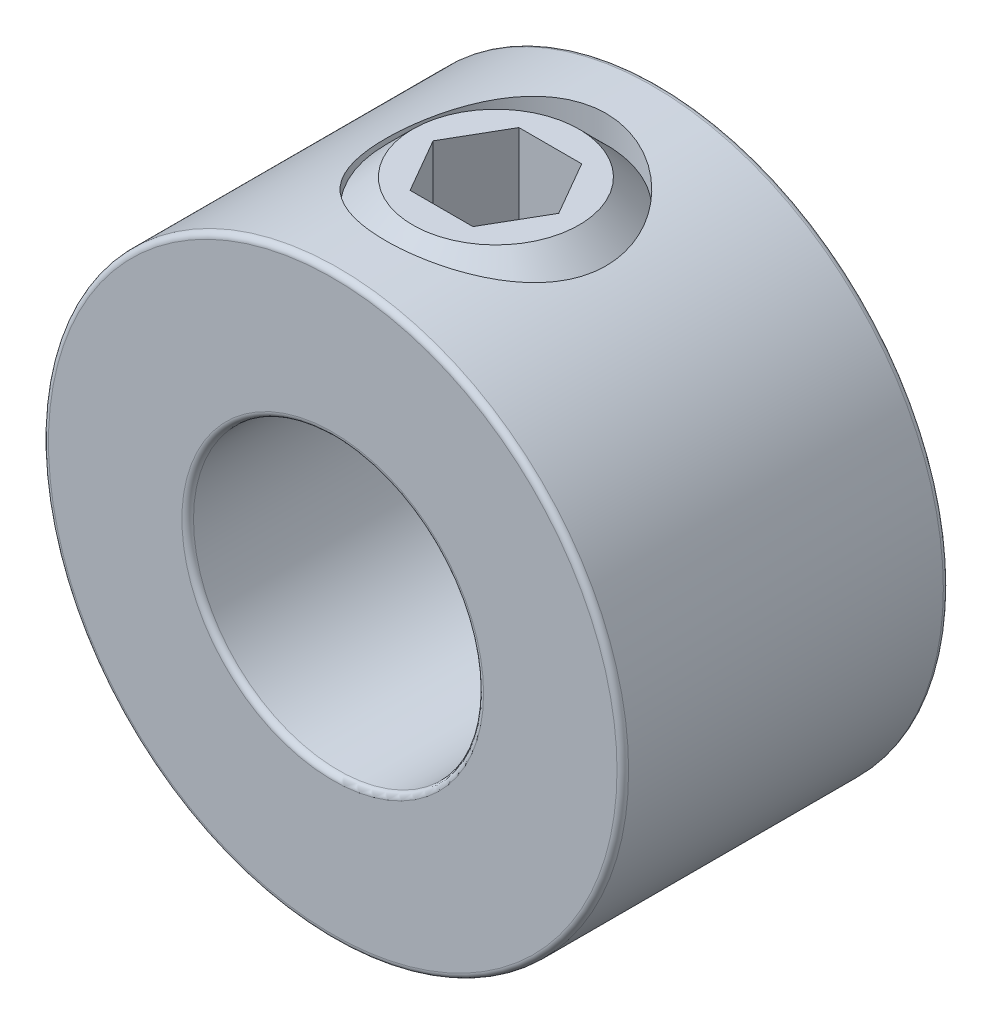
ISO-10303-21;
HEADER;
FILE_DESCRIPTION(('STEP AP214'),'2;1');
FILE_NAME('part.step','',(''),(''),'','','');
FILE_SCHEMA(('AUTOMOTIVE_DESIGN { 1 0 10303 214 1 1 1 1 }'));
ENDSEC;
DATA;
#1=APPLICATION_CONTEXT('core data for automotive mechanical design processes');
#2=APPLICATION_PROTOCOL_DEFINITION('international standard','automotive_design',2000,#1);
#3=PRODUCT_CONTEXT('',#1,'mechanical');
#4=PRODUCT('Part','Part','',(#3));
#5=PRODUCT_RELATED_PRODUCT_CATEGORY('part','',(#4));
#6=PRODUCT_DEFINITION_FORMATION('','',#4);
#7=PRODUCT_DEFINITION_CONTEXT('part definition',#1,'design');
#8=PRODUCT_DEFINITION('design','',#6,#7);
#9=PRODUCT_DEFINITION_SHAPE('','',#8);
#10=(LENGTH_UNIT() NAMED_UNIT(*) SI_UNIT(.MILLI.,.METRE.));
#11=(NAMED_UNIT(*) PLANE_ANGLE_UNIT() SI_UNIT($,.RADIAN.));
#12=(NAMED_UNIT(*) SI_UNIT($,.STERADIAN.) SOLID_ANGLE_UNIT());
#13=UNCERTAINTY_MEASURE_WITH_UNIT(LENGTH_MEASURE(1.E-05),#10,'distance_accuracy_value','');
#14=(GEOMETRIC_REPRESENTATION_CONTEXT(3) GLOBAL_UNCERTAINTY_ASSIGNED_CONTEXT((#13)) GLOBAL_UNIT_ASSIGNED_CONTEXT((#10,
#11,#12)) REPRESENTATION_CONTEXT('',''));
#15=CARTESIAN_POINT('',(0.,0.,0.));
#16=DIRECTION('',(0.,0.,1.));
#17=DIRECTION('',(1.,0.,0.));
#18=AXIS2_PLACEMENT_3D('',#15,#16,#17);
#19=CARTESIAN_POINT('',(0.,6.35,0.));
#20=DIRECTION('',(0.,1.,0.));
#21=DIRECTION('',(-1.,0.,0.));
#22=AXIS2_PLACEMENT_3D('',#19,#20,#21);
#23=PLANE('',#22);
#24=CARTESIAN_POINT('',(0.,6.35,0.));
#25=DIRECTION('',(0.,1.,0.));
#26=DIRECTION('',(-1.,0.,0.));
#27=AXIS2_PLACEMENT_3D('',#24,#25,#26);
#28=CIRCLE('',#27,1.81975161629017);
#29=CARTESIAN_POINT('',(-1.81975161629017,6.35,0.));
#30=VERTEX_POINT('',#29);
#31=EDGE_CURVE('E12',#30,#30,#28,.T.);
#32=ORIENTED_EDGE('',*,*,#31,.T.);
#33=EDGE_LOOP('',(#32));
#34=FACE_BOUND('',#33,.T.);
#35=DIRECTION('',(1.,0.,0.));
#36=VECTOR('',#35,1.);
#37=CARTESIAN_POINT('',(-0.687407664253899,6.34999999999999,-1.190625));
#38=LINE('',#37,#36);
#39=CARTESIAN_POINT('',(-0.687407664253899,6.34999999999999,-1.190625));
#40=VERTEX_POINT('',#39);
#41=CARTESIAN_POINT('',(0.687407664253899,6.35,-1.190625));
#42=VERTEX_POINT('',#41);
#43=EDGE_CURVE('E115',#40,#42,#38,.T.);
#44=ORIENTED_EDGE('',*,*,#43,.T.);
#45=DIRECTION('',(0.5,0.,0.866025403784439));
#46=VECTOR('',#45,1.);
#47=CARTESIAN_POINT('',(0.687407664253899,6.34999999999999,-1.190625));
#48=LINE('',#47,#46);
#49=CARTESIAN_POINT('',(1.3748153285078,6.34999999999999,0.));
#50=VERTEX_POINT('',#49);
#51=EDGE_CURVE('E61',#42,#50,#48,.T.);
#52=ORIENTED_EDGE('',*,*,#51,.T.);
#53=DIRECTION('',(-0.5,0.,0.866025403784439));
#54=VECTOR('',#53,1.);
#55=CARTESIAN_POINT('',(1.3748153285078,6.34999999999999,0.));
#56=LINE('',#55,#54);
#57=CARTESIAN_POINT('',(0.687407664253899,6.34999999999999,1.190625));
#58=VERTEX_POINT('',#57);
#59=EDGE_CURVE('E119',#50,#58,#56,.T.);
#60=ORIENTED_EDGE('',*,*,#59,.T.);
#61=DIRECTION('',(-1.,0.,0.));
#62=VECTOR('',#61,1.);
#63=CARTESIAN_POINT('',(0.687407664253899,6.34999999999999,1.190625));
#64=LINE('',#63,#62);
#65=CARTESIAN_POINT('',(-0.687407664253899,6.34999999999999,1.190625));
#66=VERTEX_POINT('',#65);
#67=EDGE_CURVE('E182',#58,#66,#64,.T.);
#68=ORIENTED_EDGE('',*,*,#67,.T.);
#69=DIRECTION('',(-0.5,0.,-0.866025403784439));
#70=VECTOR('',#69,1.);
#71=CARTESIAN_POINT('',(-0.687407664253899,6.34999999999999,1.190625));
#72=LINE('',#71,#70);
#73=CARTESIAN_POINT('',(-1.3748153285078,6.34999999999999,0.));
#74=VERTEX_POINT('',#73);
#75=EDGE_CURVE('E167',#66,#74,#72,.T.);
#76=ORIENTED_EDGE('',*,*,#75,.T.);
#77=DIRECTION('',(0.5,0.,-0.866025403784439));
#78=VECTOR('',#77,1.);
#79=CARTESIAN_POINT('',(-1.3748153285078,6.34999999999999,0.));
#80=LINE('',#79,#78);
#81=EDGE_CURVE('E163',#74,#40,#80,.T.);
#82=ORIENTED_EDGE('',*,*,#81,.T.);
#83=EDGE_LOOP('',(#44,#52,#60,#68,#76,#82));
#84=FACE_BOUND('',#83,.T.);
#85=ADVANCED_FACE('F47',(#34,#84),#23,.T.);
#86=CARTESIAN_POINT('',(0.,6.35,0.));
#87=DIRECTION('',(0.,-1.,0.));
#88=DIRECTION('',(1.,0.,0.));
#89=AXIS2_PLACEMENT_3D('',#86,#87,#88);
#90=CONICAL_SURFACE('',#89,1.81975161629017,0.785398163397449);
#91=CARTESIAN_POINT('',(0.,5.75675161629017,0.));
#92=DIRECTION('',(0.,1.,0.));
#93=DIRECTION('',(-1.,0.,0.));
#94=AXIS2_PLACEMENT_3D('',#91,#92,#93);
#95=CIRCLE('',#94,2.413);
#96=CARTESIAN_POINT('',(-2.413,5.75675161629017,0.));
#97=VERTEX_POINT('',#96);
#98=EDGE_CURVE('E54',#97,#97,#95,.T.);
#99=ORIENTED_EDGE('',*,*,#98,.T.);
#100=EDGE_LOOP('',(#99));
#101=FACE_BOUND('',#100,.T.);
#102=ORIENTED_EDGE('',*,*,#31,.F.);
#103=EDGE_LOOP('',(#102));
#104=FACE_BOUND('',#103,.T.);
#105=ADVANCED_FACE('F137',(#101,#104),#90,.T.);
#106=CARTESIAN_POINT('',(0.,3.175,0.));
#107=DIRECTION('',(0.,1.,0.));
#108=DIRECTION('',(-1.,0.,0.));
#109=AXIS2_PLACEMENT_3D('',#106,#107,#108);
#110=CYLINDRICAL_SURFACE('',#109,2.413);
#111=CARTESIAN_POINT('',(0.,3.76824838370983,0.));
#112=DIRECTION('',(0.,1.,0.));
#113=DIRECTION('',(-1.,0.,0.));
#114=AXIS2_PLACEMENT_3D('',#111,#112,#113);
#115=CIRCLE('',#114,2.413);
#116=CARTESIAN_POINT('',(-2.413,3.76824838370983,0.));
#117=VERTEX_POINT('',#116);
#118=EDGE_CURVE('E132',#117,#117,#115,.T.);
#119=ORIENTED_EDGE('',*,*,#118,.T.);
#120=EDGE_LOOP('',(#119));
#121=FACE_BOUND('',#120,.T.);
#122=ORIENTED_EDGE('',*,*,#98,.F.);
#123=EDGE_LOOP('',(#122));
#124=FACE_BOUND('',#123,.T.);
#125=ADVANCED_FACE('F140',(#121,#124),#110,.T.);
#126=CARTESIAN_POINT('',(0.,3.76824838370983,0.));
#127=DIRECTION('',(0.,1.,0.));
#128=DIRECTION('',(-1.,0.,0.));
#129=AXIS2_PLACEMENT_3D('',#126,#127,#128);
#130=CONICAL_SURFACE('',#129,2.413,0.785398163397448);
#131=CARTESIAN_POINT('',(0.,3.175,0.));
#132=DIRECTION('',(0.,1.,0.));
#133=DIRECTION('',(-1.,0.,0.));
#134=AXIS2_PLACEMENT_3D('',#131,#132,#133);
#135=CIRCLE('',#134,1.81975161629017);
#136=CARTESIAN_POINT('',(-1.81975161629017,3.175,0.));
#137=VERTEX_POINT('',#136);
#138=EDGE_CURVE('E124',#137,#137,#135,.T.);
#139=ORIENTED_EDGE('',*,*,#138,.T.);
#140=EDGE_LOOP('',(#139));
#141=FACE_BOUND('',#140,.T.);
#142=ORIENTED_EDGE('',*,*,#118,.F.);
#143=EDGE_LOOP('',(#142));
#144=FACE_BOUND('',#143,.T.);
#145=ADVANCED_FACE('F142',(#141,#144),#130,.T.);
#146=CARTESIAN_POINT('',(-1.81975161629017,3.175,0.));
#147=DIRECTION('',(0.,-1.,0.));
#148=DIRECTION('',(1.,0.,0.));
#149=AXIS2_PLACEMENT_3D('',#146,#147,#148);
#150=PLANE('',#149);
#151=CARTESIAN_POINT('',(0.,3.175,0.));
#152=DIRECTION('',(0.,1.,0.));
#153=DIRECTION('',(-1.,0.,0.));
#154=AXIS2_PLACEMENT_3D('',#151,#152,#153);
#155=CIRCLE('',#154,0.711898060451796);
#156=CARTESIAN_POINT('',(-0.711898060451796,3.175,0.));
#157=VERTEX_POINT('',#156);
#158=EDGE_CURVE('E120',#157,#157,#155,.T.);
#159=ORIENTED_EDGE('',*,*,#158,.T.);
#160=EDGE_LOOP('',(#159));
#161=FACE_BOUND('',#160,.T.);
#162=ORIENTED_EDGE('',*,*,#138,.F.);
#163=EDGE_LOOP('',(#162));
#164=FACE_BOUND('',#163,.T.);
#165=ADVANCED_FACE('F149',(#161,#164),#150,.T.);
#166=CARTESIAN_POINT('',(0.,3.175,0.));
#167=DIRECTION('',(0.,-1.,0.));
#168=DIRECTION('',(1.,0.,0.));
#169=AXIS2_PLACEMENT_3D('',#166,#167,#168);
#170=CONICAL_SURFACE('',#169,0.711898060451796,0.785398163397448);
#171=CARTESIAN_POINT('',(0.,3.8868980604518,0.));
#172=VERTEX_POINT('',#171);
#173=VERTEX_LOOP('',#172);
#174=FACE_BOUND('',#173,.T.);
#175=ORIENTED_EDGE('',*,*,#158,.F.);
#176=EDGE_LOOP('',(#175));
#177=FACE_BOUND('',#176,.T.);
#178=ADVANCED_FACE('F216',(#174,#177),#170,.F.);
#179=CARTESIAN_POINT('',(0.687407664253899,3.96874999999999,-1.190625));
#180=DIRECTION('',(-0.866025403784439,0.,0.5));
#181=DIRECTION('',(0.5,0.,0.866025403784438));
#182=AXIS2_PLACEMENT_3D('',#179,#180,#181);
#183=PLANE('',#182);
#184=ORIENTED_EDGE('',*,*,#51,.F.);
#185=DIRECTION('',(0.,1.,0.));
#186=VECTOR('',#185,1.);
#187=CARTESIAN_POINT('',(0.687407664253899,3.96874999999999,-1.190625));
#188=LINE('',#187,#186);
#189=CARTESIAN_POINT('',(0.687407664253899,3.96874999999999,-1.190625));
#190=VERTEX_POINT('',#189);
#191=EDGE_CURVE('E114',#190,#42,#188,.T.);
#192=ORIENTED_EDGE('',*,*,#191,.F.);
#193=DIRECTION('',(0.5,0.,0.866025403784439));
#194=VECTOR('',#193,1.);
#195=CARTESIAN_POINT('',(0.687407664253899,3.96874999999999,-1.190625));
#196=LINE('',#195,#194);
#197=CARTESIAN_POINT('',(1.3748153285078,3.96874999999999,0.));
#198=VERTEX_POINT('',#197);
#199=EDGE_CURVE('E105',#190,#198,#196,.T.);
#200=ORIENTED_EDGE('',*,*,#199,.T.);
#201=DIRECTION('',(0.,1.,0.));
#202=VECTOR('',#201,1.);
#203=CARTESIAN_POINT('',(1.3748153285078,3.96874999999999,0.));
#204=LINE('',#203,#202);
#205=EDGE_CURVE('E113',#198,#50,#204,.T.);
#206=ORIENTED_EDGE('',*,*,#205,.T.);
#207=EDGE_LOOP('',(#184,#192,#200,#206));
#208=FACE_BOUND('',#207,.T.);
#209=ADVANCED_FACE('F112',(#208),#183,.T.);
#210=CARTESIAN_POINT('',(1.3748153285078,3.96874999999999,0.));
#211=DIRECTION('',(-0.866025403784439,0.,-0.5));
#212=DIRECTION('',(-0.5,0.,0.866025403784439));
#213=AXIS2_PLACEMENT_3D('',#210,#211,#212);
#214=PLANE('',#213);
#215=ORIENTED_EDGE('',*,*,#59,.F.);
#216=ORIENTED_EDGE('',*,*,#205,.F.);
#217=DIRECTION('',(-0.5,0.,0.866025403784439));
#218=VECTOR('',#217,1.);
#219=CARTESIAN_POINT('',(1.3748153285078,3.96874999999999,0.));
#220=LINE('',#219,#218);
#221=CARTESIAN_POINT('',(0.687407664253899,3.96874999999999,1.190625));
#222=VERTEX_POINT('',#221);
#223=EDGE_CURVE('E101',#198,#222,#220,.T.);
#224=ORIENTED_EDGE('',*,*,#223,.T.);
#225=DIRECTION('',(0.,1.,0.));
#226=VECTOR('',#225,1.);
#227=CARTESIAN_POINT('',(0.687407664253899,3.96874999999999,1.190625));
#228=LINE('',#227,#226);
#229=EDGE_CURVE('E121',#222,#58,#228,.T.);
#230=ORIENTED_EDGE('',*,*,#229,.T.);
#231=EDGE_LOOP('',(#215,#216,#224,#230));
#232=FACE_BOUND('',#231,.T.);
#233=ADVANCED_FACE('F117',(#232),#214,.T.);
#234=CARTESIAN_POINT('',(0.687407664253899,3.96874999999999,1.190625));
#235=DIRECTION('',(0.,0.,-1.));
#236=DIRECTION('',(-1.,0.,0.));
#237=AXIS2_PLACEMENT_3D('',#234,#235,#236);
#238=PLANE('',#237);
#239=ORIENTED_EDGE('',*,*,#67,.F.);
#240=ORIENTED_EDGE('',*,*,#229,.F.);
#241=DIRECTION('',(-1.,0.,0.));
#242=VECTOR('',#241,1.);
#243=CARTESIAN_POINT('',(0.687407664253899,3.96874999999999,1.190625));
#244=LINE('',#243,#242);
#245=CARTESIAN_POINT('',(-0.687407664253899,3.96874999999999,1.190625));
#246=VERTEX_POINT('',#245);
#247=EDGE_CURVE('E107',#222,#246,#244,.T.);
#248=ORIENTED_EDGE('',*,*,#247,.T.);
#249=DIRECTION('',(0.,1.,0.));
#250=VECTOR('',#249,1.);
#251=CARTESIAN_POINT('',(-0.687407664253899,3.96874999999999,1.190625));
#252=LINE('',#251,#250);
#253=EDGE_CURVE('E126',#246,#66,#252,.T.);
#254=ORIENTED_EDGE('',*,*,#253,.T.);
#255=EDGE_LOOP('',(#239,#240,#248,#254));
#256=FACE_BOUND('',#255,.T.);
#257=ADVANCED_FACE('F180',(#256),#238,.T.);
#258=CARTESIAN_POINT('',(-0.687407664253899,3.96874999999999,1.190625));
#259=DIRECTION('',(0.866025403784439,0.,-0.5));
#260=DIRECTION('',(-0.5,0.,-0.866025403784438));
#261=AXIS2_PLACEMENT_3D('',#258,#259,#260);
#262=PLANE('',#261);
#263=ORIENTED_EDGE('',*,*,#75,.F.);
#264=ORIENTED_EDGE('',*,*,#253,.F.);
#265=DIRECTION('',(-0.5,0.,-0.866025403784439));
#266=VECTOR('',#265,1.);
#267=CARTESIAN_POINT('',(-0.687407664253899,3.96874999999999,1.190625));
#268=LINE('',#267,#266);
#269=CARTESIAN_POINT('',(-1.3748153285078,3.96874999999999,0.));
#270=VERTEX_POINT('',#269);
#271=EDGE_CURVE('E193',#246,#270,#268,.T.);
#272=ORIENTED_EDGE('',*,*,#271,.T.);
#273=DIRECTION('',(0.,1.,0.));
#274=VECTOR('',#273,1.);
#275=CARTESIAN_POINT('',(-1.3748153285078,3.96874999999999,0.));
#276=LINE('',#275,#274);
#277=EDGE_CURVE('E175',#270,#74,#276,.T.);
#278=ORIENTED_EDGE('',*,*,#277,.T.);
#279=EDGE_LOOP('',(#263,#264,#272,#278));
#280=FACE_BOUND('',#279,.T.);
#281=ADVANCED_FACE('F184',(#280),#262,.T.);
#282=CARTESIAN_POINT('',(-1.3748153285078,3.96874999999999,0.));
#283=DIRECTION('',(0.866025403784439,0.,0.5));
#284=DIRECTION('',(0.5,0.,-0.866025403784439));
#285=AXIS2_PLACEMENT_3D('',#282,#283,#284);
#286=PLANE('',#285);
#287=ORIENTED_EDGE('',*,*,#81,.F.);
#288=ORIENTED_EDGE('',*,*,#277,.F.);
#289=DIRECTION('',(0.5,0.,-0.866025403784439));
#290=VECTOR('',#289,1.);
#291=CARTESIAN_POINT('',(-1.3748153285078,3.96874999999999,0.));
#292=LINE('',#291,#290);
#293=CARTESIAN_POINT('',(-0.687407664253899,3.96874999999999,-1.190625));
#294=VERTEX_POINT('',#293);
#295=EDGE_CURVE('E191',#270,#294,#292,.T.);
#296=ORIENTED_EDGE('',*,*,#295,.T.);
#297=DIRECTION('',(0.,1.,0.));
#298=VECTOR('',#297,1.);
#299=CARTESIAN_POINT('',(-0.687407664253899,3.96874999999999,-1.190625));
#300=LINE('',#299,#298);
#301=EDGE_CURVE('E172',#294,#40,#300,.T.);
#302=ORIENTED_EDGE('',*,*,#301,.T.);
#303=EDGE_LOOP('',(#287,#288,#296,#302));
#304=FACE_BOUND('',#303,.T.);
#305=ADVANCED_FACE('F197',(#304),#286,.T.);
#306=CARTESIAN_POINT('',(-0.687407664253899,3.96874999999999,-1.190625));
#307=DIRECTION('',(0.,0.,1.));
#308=DIRECTION('',(1.,0.,0.));
#309=AXIS2_PLACEMENT_3D('',#306,#307,#308);
#310=PLANE('',#309);
#311=ORIENTED_EDGE('',*,*,#43,.F.);
#312=ORIENTED_EDGE('',*,*,#301,.F.);
#313=DIRECTION('',(1.,0.,0.));
#314=VECTOR('',#313,1.);
#315=CARTESIAN_POINT('',(-0.687407664253899,3.96874999999999,-1.190625));
#316=LINE('',#315,#314);
#317=EDGE_CURVE('E173',#294,#190,#316,.T.);
#318=ORIENTED_EDGE('',*,*,#317,.T.);
#319=ORIENTED_EDGE('',*,*,#191,.T.);
#320=EDGE_LOOP('',(#311,#312,#318,#319));
#321=FACE_BOUND('',#320,.T.);
#322=ADVANCED_FACE('F198',(#321),#310,.T.);
#323=CARTESIAN_POINT('',(1.3748153285078,3.96874999999999,0.));
#324=DIRECTION('',(0.,-1.,0.));
#325=DIRECTION('',(0.,0.,-1.));
#326=AXIS2_PLACEMENT_3D('',#323,#324,#325);
#327=PLANE('',#326);
#328=ORIENTED_EDGE('',*,*,#199,.F.);
#329=ORIENTED_EDGE('',*,*,#317,.F.);
#330=ORIENTED_EDGE('',*,*,#295,.F.);
#331=ORIENTED_EDGE('',*,*,#271,.F.);
#332=ORIENTED_EDGE('',*,*,#247,.F.);
#333=ORIENTED_EDGE('',*,*,#223,.F.);
#334=EDGE_LOOP('',(#328,#329,#330,#331,#332,#333));
#335=FACE_BOUND('',#334,.T.);
#336=ADVANCED_FACE('F103',(#335),#327,.F.);
#337=CLOSED_SHELL('',(#85,#105,#125,#145,#165,#178,#209,#233,#257,#281,#305,#322,#336));
#338=MANIFOLD_SOLID_BREP('B2',#337);
#339=CARTESIAN_POINT('',(0.,0.,3.571875));
#340=DIRECTION('',(0.,0.,1.));
#341=DIRECTION('',(1.,0.,0.));
#342=AXIS2_PLACEMENT_3D('',#339,#340,#341);
#343=PLANE('',#342);
#344=CARTESIAN_POINT('',(0.,0.,3.571875));
#345=DIRECTION('',(0.,0.,1.));
#346=DIRECTION('',(1.,0.,0.));
#347=AXIS2_PLACEMENT_3D('',#344,#345,#346);
#348=CIRCLE('',#347,3.302);
#349=CARTESIAN_POINT('',(3.302,0.,3.571875));
#350=VERTEX_POINT('',#349);
#351=EDGE_CURVE('E313',#350,#350,#348,.F.);
#352=ORIENTED_EDGE('',*,*,#351,.T.);
#353=EDGE_LOOP('',(#352));
#354=FACE_BOUND('',#353,.T.);
#355=CARTESIAN_POINT('',(0.,0.,3.571875));
#356=DIRECTION('',(0.,0.,1.));
#357=DIRECTION('',(1.,0.,0.));
#358=AXIS2_PLACEMENT_3D('',#355,#356,#357);
#359=CIRCLE('',#358,6.223);
#360=CARTESIAN_POINT('',(6.223,0.,3.571875));
#361=VERTEX_POINT('',#360);
#362=EDGE_CURVE('E317',#361,#361,#359,.T.);
#363=ORIENTED_EDGE('',*,*,#362,.T.);
#364=EDGE_LOOP('',(#363));
#365=FACE_BOUND('',#364,.T.);
#366=ADVANCED_FACE('F302',(#354,#365),#343,.T.);
#367=CARTESIAN_POINT('',(0.,0.,-3.571875));
#368=DIRECTION('',(0.,0.,1.));
#369=DIRECTION('',(1.,0.,0.));
#370=AXIS2_PLACEMENT_3D('',#367,#368,#369);
#371=PLANE('',#370);
#372=CARTESIAN_POINT('',(0.,0.,-3.571875));
#373=DIRECTION('',(0.,0.,1.));
#374=DIRECTION('',(1.,0.,0.));
#375=AXIS2_PLACEMENT_3D('',#372,#373,#374);
#376=CIRCLE('',#375,3.302);
#377=CARTESIAN_POINT('',(3.302,0.,-3.571875));
#378=VERTEX_POINT('',#377);
#379=EDGE_CURVE('E328',#378,#378,#376,.T.);
#380=ORIENTED_EDGE('',*,*,#379,.T.);
#381=EDGE_LOOP('',(#380));
#382=FACE_BOUND('',#381,.T.);
#383=CARTESIAN_POINT('',(0.,0.,-3.571875));
#384=DIRECTION('',(0.,0.,1.));
#385=DIRECTION('',(1.,0.,0.));
#386=AXIS2_PLACEMENT_3D('',#383,#384,#385);
#387=CIRCLE('',#386,6.223);
#388=CARTESIAN_POINT('',(6.223,0.,-3.571875));
#389=VERTEX_POINT('',#388);
#390=EDGE_CURVE('E331',#389,#389,#387,.F.);
#391=ORIENTED_EDGE('',*,*,#390,.T.);
#392=EDGE_LOOP('',(#391));
#393=FACE_BOUND('',#392,.T.);
#394=ADVANCED_FACE('F367',(#382,#393),#371,.F.);
#395=CARTESIAN_POINT('',(0.,0.,3.571875));
#396=DIRECTION('',(0.,0.,-1.));
#397=DIRECTION('',(-1.,0.,0.));
#398=AXIS2_PLACEMENT_3D('',#395,#396,#397);
#399=CYLINDRICAL_SURFACE('',#398,6.35);
#400=CARTESIAN_POINT('',(0.,0.,-3.444875));
#401=DIRECTION('',(0.,0.,1.));
#402=DIRECTION('',(1.,0.,0.));
#403=AXIS2_PLACEMENT_3D('',#400,#401,#402);
#404=CIRCLE('',#403,6.35);
#405=CARTESIAN_POINT('',(6.35,0.,-3.444875));
#406=VERTEX_POINT('',#405);
#407=EDGE_CURVE('E46',#406,#406,#404,.T.);
#408=ORIENTED_EDGE('',*,*,#407,.T.);
#409=EDGE_LOOP('',(#408));
#410=FACE_BOUND('',#409,.T.);
#411=CARTESIAN_POINT('',(0.,0.,3.444875));
#412=DIRECTION('',(0.,0.,1.));
#413=DIRECTION('',(1.,0.,0.));
#414=AXIS2_PLACEMENT_3D('',#411,#412,#413);
#415=CIRCLE('',#414,6.35);
#416=CARTESIAN_POINT('',(6.35,0.,3.444875));
#417=VERTEX_POINT('',#416);
#418=EDGE_CURVE('E309',#417,#417,#415,.F.);
#419=ORIENTED_EDGE('',*,*,#418,.T.);
#420=EDGE_LOOP('',(#419));
#421=FACE_BOUND('',#420,.T.);
#422=CARTESIAN_POINT('',(0.,6.35,-2.413));
#423=CARTESIAN_POINT('',(0.130555931467962,6.35000398969011,-2.41300527534602));
#424=CARTESIAN_POINT('',(0.261076241377739,6.34593890816647,-2.4023714543113));
#425=CARTESIAN_POINT('',(0.518209446534913,6.33012963929965,-2.36029479676423));
#426=CARTESIAN_POINT('',(0.644823015088655,6.31838678300935,-2.32885556715778));
#427=CARTESIAN_POINT('',(0.890396734122701,6.28848040494,-2.24644511602075));
#428=CARTESIAN_POINT('',(1.00937135935963,6.27032947705095,-2.19551218938446));
#429=CARTESIAN_POINT('',(1.23707694907279,6.22940932060409,-2.07575764561934));
#430=CARTESIAN_POINT('',(1.34580507871092,6.20663881943741,-2.00693109764769));
#431=CARTESIAN_POINT('',(1.5546544090621,6.15771932779737,-1.85022277092613));
#432=CARTESIAN_POINT('',(1.65427192875035,6.13147296383124,-1.76170041624995));
#433=CARTESIAN_POINT('',(1.83765571561736,6.07903240405007,-1.56947315042905));
#434=CARTESIAN_POINT('',(1.92141693988139,6.05283822744466,-1.46576342765122));
#435=CARTESIAN_POINT('',(2.07395660623911,6.00232668170519,-1.24113386470124));
#436=CARTESIAN_POINT('',(2.14201618015845,5.97812365120729,-1.11969756154783));
#437=CARTESIAN_POINT('',(2.25652093858858,5.93585432476053,-0.866038380432351));
#438=CARTESIAN_POINT('',(2.30297502037546,5.91778550353544,-0.733819969020803));
#439=CARTESIAN_POINT('',(2.37094947712185,5.89087364983883,-0.46815363189803));
#440=CARTESIAN_POINT('',(2.39343294050412,5.88167580744491,-0.334989300795486));
#441=CARTESIAN_POINT('',(2.41583880524757,5.87251090464605,-0.0664845962936197));
#442=CARTESIAN_POINT('',(2.41577084821779,5.87253989940926,0.0688548224232351));
#443=CARTESIAN_POINT('',(2.39381090108878,5.88152011871453,0.328972227003014));
#444=CARTESIAN_POINT('',(2.37326609797153,5.88992057372023,0.453886522563246));
#445=CARTESIAN_POINT('',(2.31316652422954,5.91378008823147,0.698339704990829));
#446=CARTESIAN_POINT('',(2.27360881167116,5.92924024008996,0.817877756841903));
#447=CARTESIAN_POINT('',(2.17588364092748,5.96580146890692,1.0508916152852));
#448=CARTESIAN_POINT('',(2.11737290423754,5.98700531598431,1.16420661484106));
#449=CARTESIAN_POINT('',(1.98364217411328,6.03263175509447,1.37979639920587));
#450=CARTESIAN_POINT('',(1.90841630395244,6.05705547794376,1.4820672822727));
#451=CARTESIAN_POINT('',(1.73726689770536,6.10842961274997,1.68010694238863));
#452=CARTESIAN_POINT('',(1.64027173491613,6.13543795015635,1.77493688260015));
#453=CARTESIAN_POINT('',(1.43144868882472,6.18748920351012,1.94726806056401));
#454=CARTESIAN_POINT('',(1.31961840653187,6.2125318005324,2.02476649017818));
#455=CARTESIAN_POINT('',(1.08185265975391,6.25835188225341,2.16130771487283));
#456=CARTESIAN_POINT('',(0.955717417234618,6.27905339803369,2.22002994310971));
#457=CARTESIAN_POINT('',(0.694375189035109,6.31329326294077,2.31510736575226));
#458=CARTESIAN_POINT('',(0.559172376611221,6.32683488218724,2.3514727723643));
#459=CARTESIAN_POINT('',(0.291428150212525,6.3446501972992,2.39898109857718));
#460=CARTESIAN_POINT('',(0.159141645079808,6.34938771868047,2.41138775288999));
#461=CARTESIAN_POINT('',(-0.105693065348276,6.35049981057155,2.41431626348443));
#462=CARTESIAN_POINT('',(-0.238241203822052,6.34687629478166,2.40484312768025));
#463=CARTESIAN_POINT('',(-0.494323602805378,6.33197908606406,2.36523562382545));
#464=CARTESIAN_POINT('',(-0.61800684441211,6.32101461634214,2.33593589818825));
#465=CARTESIAN_POINT('',(-0.858609565436108,6.29285092848222,2.25861304376362));
#466=CARTESIAN_POINT('',(-0.975528163914414,6.27565090041604,2.21058748264173));
#467=CARTESIAN_POINT('',(-1.20317276582384,6.23607457125026,2.09563503714011));
#468=CARTESIAN_POINT('',(-1.3136121499673,6.21355984396609,2.02818967610491));
#469=CARTESIAN_POINT('',(-1.52197988578177,6.16583504517286,1.87689595883598));
#470=CARTESIAN_POINT('',(-1.61990351002366,6.14062396176678,1.79304143465584));
#471=CARTESIAN_POINT('',(-1.80656807112922,6.08841217199752,1.60543272496061));
#472=CARTESIAN_POINT('',(-1.89441393314817,6.06139435477813,1.5007904098217));
#473=CARTESIAN_POINT('',(-2.05148411432654,6.01005496187559,1.27772800811267));
#474=CARTESIAN_POINT('',(-2.12070651399853,5.98573366426972,1.15930650314625));
#475=CARTESIAN_POINT('',(-2.23870023772464,5.94261798623815,0.910922748538602));
#476=CARTESIAN_POINT('',(-2.28736466342468,5.92385264334907,0.780904332023381));
#477=CARTESIAN_POINT('',(-2.36177800946808,5.89458517077402,0.513602694331982));
#478=CARTESIAN_POINT('',(-2.38754162954713,5.8840777409413,0.376324193363579));
#479=CARTESIAN_POINT('',(-2.41408994040532,5.87323215610138,0.108127165215383));
#480=CARTESIAN_POINT('',(-2.41640623148607,5.87227054588007,-0.0226157343841075));
#481=CARTESIAN_POINT('',(-2.3999373204655,5.8790202253426,-0.282524873396556));
#482=CARTESIAN_POINT('',(-2.38115423316032,5.88673064582666,-0.41169126951125));
#483=CARTESIAN_POINT('',(-2.32422421188573,5.90943043237583,-0.660552265849344));
#484=CARTESIAN_POINT('',(-2.28672002796391,5.92417751295514,-0.780417919491674));
#485=CARTESIAN_POINT('',(-2.19398528189399,5.95914188552999,-1.01222145618602));
#486=CARTESIAN_POINT('',(-2.13875018285588,5.97936057736356,-1.12415730124382));
#487=CARTESIAN_POINT('',(-2.00869997639504,6.02433337271119,-1.34342800575803));
#488=CARTESIAN_POINT('',(-1.93299650808671,6.04927206356278,-1.4501976241717));
#489=CARTESIAN_POINT('',(-1.76551836882645,6.10025417003155,-1.65000619367226));
#490=CARTESIAN_POINT('',(-1.67373852090438,6.12629793945648,-1.74304070389426));
#491=CARTESIAN_POINT('',(-1.47055494697206,6.17831294001547,-1.91807209951937));
#492=CARTESIAN_POINT('',(-1.35833856072122,6.20419794006484,-1.99915556641372));
#493=CARTESIAN_POINT('',(-1.12096041375387,6.25144642675378,-2.14129762074769));
#494=CARTESIAN_POINT('',(-0.995797050693124,6.27280935273315,-2.20235372565052));
#495=CARTESIAN_POINT('',(-0.728778395788011,6.30955475572144,-2.30499263616226));
#496=CARTESIAN_POINT('',(-0.58638469778337,6.32454657619379,-2.3453288052365));
#497=CARTESIAN_POINT('',(-0.295976705251577,6.34476431329028,-2.39932232882264));
#498=CARTESIAN_POINT('',(-0.147965475024477,6.34999547828747,-2.41299402119021));
#499=CARTESIAN_POINT('',(0.,6.35,-2.413));
#500=B_SPLINE_CURVE_WITH_KNOTS('',3,(#422,#423,#424,#425,#426,#427,#428,#429,#430,#431,#432,
#433,#434,#435,#436,#437,#438,#439,#440,#441,#442,#443,#444,#445,#446,#447,#448,#449,#450,#451,
#452,#453,#454,#455,#456,#457,#458,#459,#460,#461,#462,#463,#464,#465,#466,#467,#468,#469,#470,
#471,#472,#473,#474,#475,#476,#477,#478,#479,#480,#481,#482,#483,#484,#485,#486,#487,#488,#489,
#490,#491,#492,#493,#494,#495,#496,#497,#498,#499),.UNSPECIFIED.,.T.,.F.,(4,2,2,2,2,2,2,2,2,2,2,
2,2,2,2,2,2,2,2,2,2,2,2,2,2,2,2,2,2,2,2,2,2,2,2,2,2,2,4),(0.,0.391121887064184,
0.782175985486185,1.17246577830223,1.56286323524963,1.96854634212709,2.37435825594016,
2.79613130529395,3.21773051175688,3.62166628723491,4.02542936468621,4.40427313209371,
4.78317553819666,5.16936515238192,5.55569075901495,5.96873424705112,6.38184461005431,
6.80167192308661,7.22130732355892,7.61812936188612,8.01486058335588,8.39585156202364,
8.77689204483065,9.16923685274999,9.56172942118012,9.9776135359701,10.3935404987953,
10.8116043631128,11.2293996833676,11.6197130905881,12.0099873800853,12.3876994067832,
12.7655081575183,13.1635000328781,13.5616203073395,13.9821012344605,14.4026342635628,
14.8461505355472,15.2894282569131),.UNSPECIFIED.);
#501=CARTESIAN_POINT('',(0.,6.35,-2.413));
#502=VERTEX_POINT('',#501);
#503=EDGE_CURVE('E334',#502,#502,#500,.T.);
#504=ORIENTED_EDGE('',*,*,#503,.T.);
#505=EDGE_LOOP('',(#504));
#506=FACE_BOUND('',#505,.T.);
#507=ADVANCED_FACE('F363',(#410,#421,#506),#399,.T.);
#508=CARTESIAN_POINT('',(0.,0.,3.571875));
#509=DIRECTION('',(0.,0.,-1.));
#510=DIRECTION('',(-1.,0.,0.));
#511=AXIS2_PLACEMENT_3D('',#508,#509,#510);
#512=CYLINDRICAL_SURFACE('',#511,3.175);
#513=CARTESIAN_POINT('',(0.,0.,-3.444875));
#514=DIRECTION('',(0.,0.,1.));
#515=DIRECTION('',(1.,0.,0.));
#516=AXIS2_PLACEMENT_3D('',#513,#514,#515);
#517=CIRCLE('',#516,3.175);
#518=CARTESIAN_POINT('',(3.175,0.,-3.444875));
#519=VERTEX_POINT('',#518);
#520=EDGE_CURVE('E322',#519,#519,#517,.F.);
#521=ORIENTED_EDGE('',*,*,#520,.T.);
#522=EDGE_LOOP('',(#521));
#523=FACE_BOUND('',#522,.T.);
#524=CARTESIAN_POINT('',(0.,0.,3.444875));
#525=DIRECTION('',(0.,0.,1.));
#526=DIRECTION('',(1.,0.,0.));
#527=AXIS2_PLACEMENT_3D('',#524,#525,#526);
#528=CIRCLE('',#527,3.175);
#529=CARTESIAN_POINT('',(3.175,0.,3.444875));
#530=VERTEX_POINT('',#529);
#531=EDGE_CURVE('E325',#530,#530,#528,.T.);
#532=ORIENTED_EDGE('',*,*,#531,.T.);
#533=EDGE_LOOP('',(#532));
#534=FACE_BOUND('',#533,.T.);
#535=CARTESIAN_POINT('',(0.,3.175,-2.413));
#536=CARTESIAN_POINT('',(0.117443171605231,3.17499092904906,-2.41299058031907));
#537=CARTESIAN_POINT('',(0.23503818841931,3.16841692674332,-2.4043581847269));
#538=CARTESIAN_POINT('',(0.466484967913331,3.14271336140829,-2.37038175457781));
#539=CARTESIAN_POINT('',(0.580328596183407,3.12355818632314,-2.34500362950094));
#540=CARTESIAN_POINT('',(0.80033693546367,3.07452724978738,-2.27928432631256));
#541=CARTESIAN_POINT('',(0.906543039514099,3.04471549355359,-2.23903243487973));
#542=CARTESIAN_POINT('',(1.10997011785933,2.97659455342082,-2.14548015839209));
#543=CARTESIAN_POINT('',(1.20719255384311,2.93828675533249,-2.09218190121579));
#544=CARTESIAN_POINT('',(1.40022726688529,2.85170030734834,-1.96882085307546));
#545=CARTESIAN_POINT('',(1.49506365463583,2.80282512985173,-1.89765858122501));
#546=CARTESIAN_POINT('',(1.67223382567996,2.7008760546092,-1.7435641158176));
#547=CARTESIAN_POINT('',(1.75454859398162,2.64779595363648,-1.66061438438314));
#548=CARTESIAN_POINT('',(1.92203888294129,2.5296135351956,-1.46565859240837));
#549=CARTESIAN_POINT('',(2.00423140536036,2.4643124367144,-1.35120048467098));
#550=CARTESIAN_POINT('',(2.14857118710811,2.33951215894306,-1.10735736644856));
#551=CARTESIAN_POINT('',(2.21074385995913,2.28000569136514,-0.977991565717825));
#552=CARTESIAN_POINT('',(2.29462037317499,2.19490180220151,-0.752497308608559));
#553=CARTESIAN_POINT('',(2.32287346332998,2.16472241167552,-0.66055827907226));
#554=CARTESIAN_POINT('',(2.36849823013454,2.11470881226284,-0.47139038700259));
#555=CARTESIAN_POINT('',(2.38589523743028,2.09485053921884,-0.374174418255039));
#556=CARTESIAN_POINT('',(2.40870358471578,2.06860028206587,-0.175460476777278));
#557=CARTESIAN_POINT('',(2.4139959431512,2.06234200752845,-0.073929905731699));
#558=CARTESIAN_POINT('',(2.41169213967819,2.06503422028968,0.128798184800726));
#559=CARTESIAN_POINT('',(2.40409306334661,2.07398814667793,0.22999562379254));
#560=CARTESIAN_POINT('',(2.37836508518799,2.10340433920656,0.416917246134645));
#561=CARTESIAN_POINT('',(2.36156171265492,2.1224091464969,0.503073429560243));
#562=CARTESIAN_POINT('',(2.31942910669347,2.16837457604816,0.671064962974234));
#563=CARTESIAN_POINT('',(2.29409116468348,2.19534332114491,0.752895800354834));
#564=CARTESIAN_POINT('',(2.21702947004233,2.27376916611904,0.962631680289748));
#565=CARTESIAN_POINT('',(2.15880606368402,2.32983777456744,1.08642083974007));
#566=CARTESIAN_POINT('',(2.0240584670168,2.44783368287627,1.32063556736185));
#567=CARTESIAN_POINT('',(1.94748865288627,2.50977535205404,1.43102676980356));
#568=CARTESIAN_POINT('',(1.77457755480707,2.63500191833982,1.64086400526623));
#569=CARTESIAN_POINT('',(1.67772908569284,2.69827393808612,1.73990181478264));
#570=CARTESIAN_POINT('',(1.46641465679805,2.81868720555883,1.92133244794249));
#571=CARTESIAN_POINT('',(1.35198192561174,2.87583967861316,2.00375600179513));
#572=CARTESIAN_POINT('',(1.1302184691796,2.96897239724258,2.13504920976438));
#573=CARTESIAN_POINT('',(1.02573469648465,3.00691100546587,2.18732233798596));
#574=CARTESIAN_POINT('',(0.807524498934965,3.07269924184988,2.27691743542351));
#575=CARTESIAN_POINT('',(0.693803632023793,3.10055488265641,2.31424831636675));
#576=CARTESIAN_POINT('',(0.458986561176873,3.14392869528766,2.37204565582169));
#577=CARTESIAN_POINT('',(0.337846653718269,3.15936426972399,2.39239924216467));
#578=CARTESIAN_POINT('',(0.0929212408274502,3.17600778354888,2.41433718167044));
#579=CARTESIAN_POINT('',(-0.0308628412677098,3.17722319336241,2.41593138989231));
#580=CARTESIAN_POINT('',(-0.263113673769308,3.16598164725166,2.40112430213952));
#581=CARTESIAN_POINT('',(-0.371784896474092,3.15499411480433,2.38665711938384));
#582=CARTESIAN_POINT('',(-0.584657379974265,3.12256258934286,2.34361709819449));
#583=CARTESIAN_POINT('',(-0.688857782558675,3.10111659842469,2.31504156459624));
#584=CARTESIAN_POINT('',(-0.893151752270642,3.04866013703249,2.24429284461138));
#585=CARTESIAN_POINT('',(-0.993066473951875,3.01741404656932,2.20178337061745));
#586=CARTESIAN_POINT('',(-1.18427030490273,2.94762615076737,2.10512741976429));
#587=CARTESIAN_POINT('',(-1.27555811070553,2.90908324556455,2.05097918840424));
#588=CARTESIAN_POINT('',(-1.4629408219305,2.82008518778891,1.92283493337221));
#589=CARTESIAN_POINT('',(-1.55736336530955,2.76871323654288,1.84703979297132));
#590=CARTESIAN_POINT('',(-1.7330266340156,2.66229345480278,1.68334400808498));
#591=CARTESIAN_POINT('',(-1.81424018707203,2.60723836781931,1.59541908083344));
#592=CARTESIAN_POINT('',(-1.93310120506622,2.51929011373857,1.44596227809647));
#593=CARTESIAN_POINT('',(-1.97518148865632,2.48634042838264,1.38794003709871));
#594=CARTESIAN_POINT('',(-2.05424288960517,2.42143291492003,1.26799956797446));
#595=CARTESIAN_POINT('',(-2.09122218168265,2.38947544500995,1.2060799567393));
#596=CARTESIAN_POINT('',(-2.19405069763864,2.29677780916441,1.01470921513655));
#597=CARTESIAN_POINT('',(-2.25209423008379,2.2389759481709,0.879267670433414));
#598=CARTESIAN_POINT('',(-2.32600727289693,2.16148731453314,0.648667618119571));
#599=CARTESIAN_POINT('',(-2.34951337659766,2.13568591161393,0.557995127674168));
#600=CARTESIAN_POINT('',(-2.38597736286025,2.09487284834006,0.372275602812797));
#601=CARTESIAN_POINT('',(-2.39896041795918,2.0798354491901,0.277239585981548));
#602=CARTESIAN_POINT('',(-2.41347202601588,2.06298898322372,0.0843820043038626));
#603=CARTESIAN_POINT('',(-2.41491881071071,2.06127434940024,-0.0134545208329241));
#604=CARTESIAN_POINT('',(-2.40600289841214,2.07166816759277,-0.20788213648133));
#605=CARTESIAN_POINT('',(-2.39562846174622,2.08379036100337,-0.304471892411458));
#606=CARTESIAN_POINT('',(-2.36137219311358,2.12256830664758,-0.508834367656112));
#607=CARTESIAN_POINT('',(-2.33557340769404,2.15126142901359,-0.615881798172457));
#608=CARTESIAN_POINT('',(-2.27108364148613,2.21923176610734,-0.822515613730422));
#609=CARTESIAN_POINT('',(-2.2323592210675,2.25853638265596,-0.922081817130457));
#610=CARTESIAN_POINT('',(-2.12610942507655,2.35955877527054,-1.15053309693759));
#611=CARTESIAN_POINT('',(-2.05324191025264,2.42403799567888,-1.27569998264042));
#612=CARTESIAN_POINT('',(-1.88728411653423,2.55539518076956,-1.5104318596925));
#613=CARTESIAN_POINT('',(-1.79417076882036,2.62227580852244,-1.61997881541957));
#614=CARTESIAN_POINT('',(-1.58693666845894,2.75272337581287,-1.82362287315767));
#615=CARTESIAN_POINT('',(-1.47252844795802,2.81622750409905,-1.9174704362987));
#616=CARTESIAN_POINT('',(-1.22472214874906,2.93245405690648,-2.0844185884594));
#617=CARTESIAN_POINT('',(-1.09136873492959,2.9852011492147,-2.15756679766189));
#618=CARTESIAN_POINT('',(-0.848324156263042,3.06143310070406,-2.2616762509508));
#619=CARTESIAN_POINT('',(-0.742491250018576,3.08897584082985,-2.29871569194653));
#620=CARTESIAN_POINT('',(-0.524711420429954,3.13329848559572,-2.35794338327758));
#621=CARTESIAN_POINT('',(-0.412780537897338,3.1501052759874,-2.38016873825137));
#622=CARTESIAN_POINT('',(-0.249887399880881,3.16554486424948,-2.40054788675386));
#623=CARTESIAN_POINT('',(-0.200104041382905,3.16908209053624,-2.40520884201812));
#624=CARTESIAN_POINT('',(-0.10022305414221,3.17381185752955,-2.41143725628489));
#625=CARTESIAN_POINT('',(-0.0501253573366512,3.17500387152911,-2.41300402036888));
#626=CARTESIAN_POINT('',(0.,3.175,-2.413));
#627=B_SPLINE_CURVE_WITH_KNOTS('',3,(#535,#536,#537,#538,#539,#540,#541,#542,#543,#544,#545,
#546,#547,#548,#549,#550,#551,#552,#553,#554,#555,#556,#557,#558,#559,#560,#561,#562,#563,#564,
#565,#566,#567,#568,#569,#570,#571,#572,#573,#574,#575,#576,#577,#578,#579,#580,#581,#582,#583,
#584,#585,#586,#587,#588,#589,#590,#591,#592,#593,#594,#595,#596,#597,#598,#599,#600,#601,#602,
#603,#604,#605,#606,#607,#608,#609,#610,#611,#612,#613,#614,#615,#616,#617,#618,#619,#620,#621,
#622,#623,#624,#625,#626),.UNSPECIFIED.,.T.,.F.,(4,2,2,2,2,2,2,2,2,2,2,2,2,2,2,2,2,2,2,2,2,2,2,
2,2,2,2,2,2,2,2,2,2,2,2,2,2,2,2,2,2,2,2,2,2,4),(0.,0.352113770291782,0.704946585369681,
1.05569488379078,1.40638601280107,1.78976092813112,2.17371233600607,2.63773050853704,
3.10115730525324,3.40258553658297,3.70330778533679,4.00697348207613,4.31070783899934,
4.57916413533347,4.84789519559245,5.28900480236595,5.73122295780719,6.18621377116464,
6.64035513804427,7.00739894320242,7.37422351187941,7.74346787257931,8.11251824563582,
8.44151894934109,8.77058252746343,9.10825790412116,9.44598421987268,9.83917081589853,
10.2331562784928,10.469557715449,10.7060435254032,11.1774135342105,11.4679029980311,
11.757695504225,12.0495402292483,12.3416750384965,12.6811651199407,13.0215403855346,
13.4947220530831,13.9684457327182,14.4491015240246,14.9286423754468,15.2736416515379,
15.6177735325977,15.768023783139,15.9183077742625),.UNSPECIFIED.);
#628=CARTESIAN_POINT('',(0.,3.175,-2.413));
#629=VERTEX_POINT('',#628);
#630=EDGE_CURVE('E335',#629,#629,#627,.T.);
#631=ORIENTED_EDGE('',*,*,#630,.F.);
#632=EDGE_LOOP('',(#631));
#633=FACE_BOUND('',#632,.T.);
#634=ADVANCED_FACE('F347',(#523,#534,#633),#512,.F.);
#635=CARTESIAN_POINT('',(0.,6.35,0.));
#636=DIRECTION('',(0.,-1.,0.));
#637=DIRECTION('',(0.,0.,-1.));
#638=AXIS2_PLACEMENT_3D('',#635,#636,#637);
#639=CYLINDRICAL_SURFACE('',#638,2.413);
#640=ORIENTED_EDGE('',*,*,#630,.T.);
#641=EDGE_LOOP('',(#640));
#642=FACE_BOUND('',#641,.T.);
#643=ORIENTED_EDGE('',*,*,#503,.F.);
#644=EDGE_LOOP('',(#643));
#645=FACE_BOUND('',#644,.T.);
#646=ADVANCED_FACE('F350',(#642,#645),#639,.F.);
#647=CARTESIAN_POINT('',(0.,0.,-3.444875));
#648=DIRECTION('',(0.,0.,1.));
#649=DIRECTION('',(1.,0.,0.));
#650=AXIS2_PLACEMENT_3D('',#647,#648,#649);
#651=TOROIDAL_SURFACE('',#650,3.302,0.127);
#652=ORIENTED_EDGE('',*,*,#520,.F.);
#653=EDGE_LOOP('',(#652));
#654=FACE_BOUND('',#653,.T.);
#655=ORIENTED_EDGE('',*,*,#379,.F.);
#656=EDGE_LOOP('',(#655));
#657=FACE_BOUND('',#656,.T.);
#658=ADVANCED_FACE('F353',(#654,#657),#651,.T.);
#659=CARTESIAN_POINT('',(0.,0.,3.444875));
#660=DIRECTION('',(0.,0.,1.));
#661=DIRECTION('',(1.,0.,0.));
#662=AXIS2_PLACEMENT_3D('',#659,#660,#661);
#663=TOROIDAL_SURFACE('',#662,3.302,0.127);
#664=ORIENTED_EDGE('',*,*,#351,.F.);
#665=EDGE_LOOP('',(#664));
#666=FACE_BOUND('',#665,.T.);
#667=ORIENTED_EDGE('',*,*,#531,.F.);
#668=EDGE_LOOP('',(#667));
#669=FACE_BOUND('',#668,.T.);
#670=ADVANCED_FACE('F360',(#666,#669),#663,.T.);
#671=CARTESIAN_POINT('',(0.,0.,-3.444875));
#672=DIRECTION('',(0.,0.,1.));
#673=DIRECTION('',(1.,0.,0.));
#674=AXIS2_PLACEMENT_3D('',#671,#672,#673);
#675=TOROIDAL_SURFACE('',#674,6.223,0.127);
#676=ORIENTED_EDGE('',*,*,#390,.F.);
#677=EDGE_LOOP('',(#676));
#678=FACE_BOUND('',#677,.T.);
#679=ORIENTED_EDGE('',*,*,#407,.F.);
#680=EDGE_LOOP('',(#679));
#681=FACE_BOUND('',#680,.T.);
#682=ADVANCED_FACE('F379',(#678,#681),#675,.T.);
#683=CARTESIAN_POINT('',(0.,0.,3.444875));
#684=DIRECTION('',(0.,0.,1.));
#685=DIRECTION('',(1.,0.,0.));
#686=AXIS2_PLACEMENT_3D('',#683,#684,#685);
#687=TOROIDAL_SURFACE('',#686,6.223,0.127);
#688=ORIENTED_EDGE('',*,*,#418,.F.);
#689=EDGE_LOOP('',(#688));
#690=FACE_BOUND('',#689,.T.);
#691=ORIENTED_EDGE('',*,*,#362,.F.);
#692=EDGE_LOOP('',(#691));
#693=FACE_BOUND('',#692,.T.);
#694=ADVANCED_FACE('F304',(#690,#693),#687,.T.);
#695=CLOSED_SHELL('',(#366,#394,#507,#634,#646,#658,#670,#682,#694));
#696=MANIFOLD_SOLID_BREP('B6',#695);
#697=ADVANCED_BREP_SHAPE_REPRESENTATION('',(#18,#338,#696),#14);
#698=SHAPE_DEFINITION_REPRESENTATION(#9,#697);
ENDSEC;
END-ISO-10303-21;
